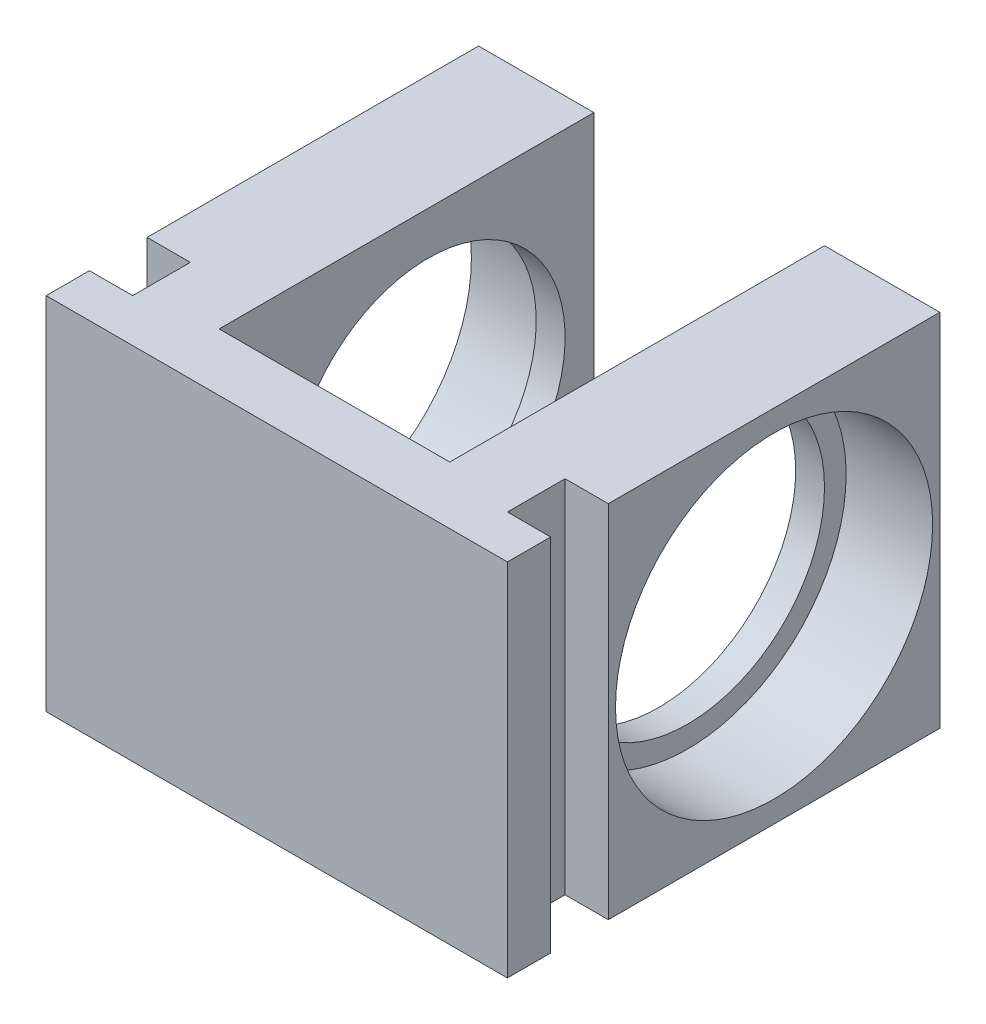
ISO-10303-21;
HEADER;
FILE_DESCRIPTION(('STEP AP214'),'2;1');
FILE_NAME('part.step','',(''),(''),'','','');
FILE_SCHEMA(('AUTOMOTIVE_DESIGN { 1 0 10303 214 1 1 1 1 }'));
ENDSEC;
DATA;
#1=APPLICATION_CONTEXT('core data for automotive mechanical design processes');
#2=APPLICATION_PROTOCOL_DEFINITION('international standard','automotive_design',2000,#1);
#3=PRODUCT_CONTEXT('',#1,'mechanical');
#4=PRODUCT('Part','Part','',(#3));
#5=PRODUCT_RELATED_PRODUCT_CATEGORY('part','',(#4));
#6=PRODUCT_DEFINITION_FORMATION('','',#4);
#7=PRODUCT_DEFINITION_CONTEXT('part definition',#1,'design');
#8=PRODUCT_DEFINITION('design','',#6,#7);
#9=PRODUCT_DEFINITION_SHAPE('','',#8);
#10=(LENGTH_UNIT() NAMED_UNIT(*) SI_UNIT(.MILLI.,.METRE.));
#11=(NAMED_UNIT(*) PLANE_ANGLE_UNIT() SI_UNIT($,.RADIAN.));
#12=(NAMED_UNIT(*) SI_UNIT($,.STERADIAN.) SOLID_ANGLE_UNIT());
#13=UNCERTAINTY_MEASURE_WITH_UNIT(LENGTH_MEASURE(1.E-05),#10,'distance_accuracy_value','');
#14=(GEOMETRIC_REPRESENTATION_CONTEXT(3) GLOBAL_UNCERTAINTY_ASSIGNED_CONTEXT((#13)) GLOBAL_UNIT_ASSIGNED_CONTEXT((#10,
#11,#12)) REPRESENTATION_CONTEXT('',''));
#15=CARTESIAN_POINT('',(0.,0.,0.));
#16=DIRECTION('',(0.,0.,1.));
#17=DIRECTION('',(1.,0.,0.));
#18=AXIS2_PLACEMENT_3D('',#15,#16,#17);
#19=CARTESIAN_POINT('',(19.,12.5,-14.5));
#20=DIRECTION('',(-1.,0.,0.));
#21=DIRECTION('',(0.,0.,1.));
#22=AXIS2_PLACEMENT_3D('',#19,#20,#21);
#23=CYLINDRICAL_SURFACE('',#22,9.5);
#24=CARTESIAN_POINT('',(8.,12.5,-14.5));
#25=DIRECTION('',(1.,0.,0.));
#26=DIRECTION('',(0.,0.,-1.));
#27=AXIS2_PLACEMENT_3D('',#24,#25,#26);
#28=CIRCLE('',#27,9.5);
#29=CARTESIAN_POINT('',(8.,12.5,-24.));
#30=VERTEX_POINT('',#29);
#31=EDGE_CURVE('E272',#30,#30,#28,.T.);
#32=ORIENTED_EDGE('',*,*,#31,.F.);
#33=EDGE_LOOP('',(#32));
#34=FACE_BOUND('',#33,.T.);
#35=CARTESIAN_POINT('',(10.,12.5,-14.5));
#36=DIRECTION('',(1.,0.,0.));
#37=DIRECTION('',(0.,0.,-1.));
#38=AXIS2_PLACEMENT_3D('',#35,#36,#37);
#39=CIRCLE('',#38,9.5);
#40=CARTESIAN_POINT('',(10.,12.5,-24.));
#41=VERTEX_POINT('',#40);
#42=EDGE_CURVE('E39',#41,#41,#39,.F.);
#43=ORIENTED_EDGE('',*,*,#42,.F.);
#44=EDGE_LOOP('',(#43));
#45=FACE_BOUND('',#44,.T.);
#46=ADVANCED_FACE('F35',(#34,#45),#23,.F.);
#47=CARTESIAN_POINT('',(-8.,12.5,-14.5));
#48=DIRECTION('',(-1.,0.,0.));
#49=DIRECTION('',(0.,0.,1.));
#50=AXIS2_PLACEMENT_3D('',#47,#48,#49);
#51=CIRCLE('',#50,9.5);
#52=CARTESIAN_POINT('',(-8.,12.5,-4.99999999999999));
#53=VERTEX_POINT('',#52);
#54=EDGE_CURVE('E176',#53,#53,#51,.T.);
#55=ORIENTED_EDGE('',*,*,#54,.F.);
#56=EDGE_LOOP('',(#55));
#57=FACE_BOUND('',#56,.T.);
#58=CARTESIAN_POINT('',(-10.,12.5,-14.5));
#59=DIRECTION('',(-1.,0.,0.));
#60=DIRECTION('',(0.,0.,1.));
#61=AXIS2_PLACEMENT_3D('',#58,#59,#60);
#62=CIRCLE('',#61,9.5);
#63=CARTESIAN_POINT('',(-10.,12.5,-4.99999999999999));
#64=VERTEX_POINT('',#63);
#65=EDGE_CURVE('E274',#64,#64,#62,.F.);
#66=ORIENTED_EDGE('',*,*,#65,.F.);
#67=EDGE_LOOP('',(#66));
#68=FACE_BOUND('',#67,.T.);
#69=ADVANCED_FACE('F299',(#57,#68),#23,.F.);
#70=CARTESIAN_POINT('',(-16.,25.,-26.));
#71=DIRECTION('',(1.,0.,0.));
#72=DIRECTION('',(0.,0.,-1.));
#73=AXIS2_PLACEMENT_3D('',#70,#71,#72);
#74=PLANE('',#73);
#75=CARTESIAN_POINT('',(-16.,12.5,-14.5));
#76=DIRECTION('',(-1.,0.,0.));
#77=DIRECTION('',(0.,0.,1.));
#78=AXIS2_PLACEMENT_3D('',#75,#76,#77);
#79=CIRCLE('',#78,11.);
#80=CARTESIAN_POINT('',(-16.,12.5,-3.49999999999999));
#81=VERTEX_POINT('',#80);
#82=EDGE_CURVE('E280',#81,#81,#79,.T.);
#83=ORIENTED_EDGE('',*,*,#82,.F.);
#84=EDGE_LOOP('',(#83));
#85=FACE_BOUND('',#84,.T.);
#86=DIRECTION('',(0.,0.,1.));
#87=VECTOR('',#86,1.);
#88=CARTESIAN_POINT('',(-16.,0.,-26.));
#89=LINE('',#88,#87);
#90=CARTESIAN_POINT('',(-16.,0.,-26.));
#91=VERTEX_POINT('',#90);
#92=CARTESIAN_POINT('',(-16.,0.,-2.99999999999999));
#93=VERTEX_POINT('',#92);
#94=EDGE_CURVE('E241',#91,#93,#89,.T.);
#95=ORIENTED_EDGE('',*,*,#94,.T.);
#96=DIRECTION('',(0.,-1.,0.));
#97=VECTOR('',#96,1.);
#98=CARTESIAN_POINT('',(-16.,25.,-2.99999999999999));
#99=LINE('',#98,#97);
#100=CARTESIAN_POINT('',(-16.,25.,-2.99999999999999));
#101=VERTEX_POINT('',#100);
#102=EDGE_CURVE('E182',#101,#93,#99,.T.);
#103=ORIENTED_EDGE('',*,*,#102,.F.);
#104=DIRECTION('',(0.,0.,1.));
#105=VECTOR('',#104,1.);
#106=CARTESIAN_POINT('',(-16.,25.,-26.));
#107=LINE('',#106,#105);
#108=CARTESIAN_POINT('',(-16.,25.,-26.));
#109=VERTEX_POINT('',#108);
#110=EDGE_CURVE('E170',#109,#101,#107,.T.);
#111=ORIENTED_EDGE('',*,*,#110,.F.);
#112=DIRECTION('',(0.,-1.,0.));
#113=VECTOR('',#112,1.);
#114=CARTESIAN_POINT('',(-16.,25.,-26.));
#115=LINE('',#114,#113);
#116=EDGE_CURVE('E267',#109,#91,#115,.T.);
#117=ORIENTED_EDGE('',*,*,#116,.T.);
#118=EDGE_LOOP('',(#95,#103,#111,#117));
#119=FACE_BOUND('',#118,.T.);
#120=ADVANCED_FACE('F305',(#85,#119),#74,.F.);
#121=CARTESIAN_POINT('',(16.,25.,-26.));
#122=DIRECTION('',(-1.,0.,0.));
#123=DIRECTION('',(0.,0.,1.));
#124=AXIS2_PLACEMENT_3D('',#121,#122,#123);
#125=PLANE('',#124);
#126=CARTESIAN_POINT('',(16.,12.5,-14.5));
#127=DIRECTION('',(1.,0.,0.));
#128=DIRECTION('',(0.,0.,-1.));
#129=AXIS2_PLACEMENT_3D('',#126,#127,#128);
#130=CIRCLE('',#129,11.);
#131=CARTESIAN_POINT('',(16.,12.5,-25.5));
#132=VERTEX_POINT('',#131);
#133=EDGE_CURVE('E286',#132,#132,#130,.T.);
#134=ORIENTED_EDGE('',*,*,#133,.F.);
#135=EDGE_LOOP('',(#134));
#136=FACE_BOUND('',#135,.T.);
#137=DIRECTION('',(0.,0.,-1.));
#138=VECTOR('',#137,1.);
#139=CARTESIAN_POINT('',(16.,25.,-26.));
#140=LINE('',#139,#138);
#141=CARTESIAN_POINT('',(16.,25.,-2.99999999999999));
#142=VERTEX_POINT('',#141);
#143=CARTESIAN_POINT('',(16.,25.,-26.));
#144=VERTEX_POINT('',#143);
#145=EDGE_CURVE('E225',#142,#144,#140,.T.);
#146=ORIENTED_EDGE('',*,*,#145,.F.);
#147=DIRECTION('',(0.,-1.,0.));
#148=VECTOR('',#147,1.);
#149=CARTESIAN_POINT('',(16.,25.,-2.99999999999999));
#150=LINE('',#149,#148);
#151=CARTESIAN_POINT('',(16.,0.,-2.99999999999999));
#152=VERTEX_POINT('',#151);
#153=EDGE_CURVE('E204',#142,#152,#150,.T.);
#154=ORIENTED_EDGE('',*,*,#153,.T.);
#155=DIRECTION('',(0.,0.,-1.));
#156=VECTOR('',#155,1.);
#157=CARTESIAN_POINT('',(16.,0.,-26.));
#158=LINE('',#157,#156);
#159=CARTESIAN_POINT('',(16.,0.,-26.));
#160=VERTEX_POINT('',#159);
#161=EDGE_CURVE('E246',#152,#160,#158,.T.);
#162=ORIENTED_EDGE('',*,*,#161,.T.);
#163=DIRECTION('',(0.,-1.,0.));
#164=VECTOR('',#163,1.);
#165=CARTESIAN_POINT('',(16.,25.,-26.));
#166=LINE('',#165,#164);
#167=EDGE_CURVE('E258',#144,#160,#166,.T.);
#168=ORIENTED_EDGE('',*,*,#167,.F.);
#169=EDGE_LOOP('',(#146,#154,#162,#168));
#170=FACE_BOUND('',#169,.T.);
#171=ADVANCED_FACE('F351',(#136,#170),#125,.F.);
#172=CARTESIAN_POINT('',(8.,25.,0.));
#173=DIRECTION('',(0.,0.,1.));
#174=DIRECTION('',(1.,0.,0.));
#175=AXIS2_PLACEMENT_3D('',#172,#173,#174);
#176=PLANE('',#175);
#177=DIRECTION('',(-1.,0.,0.));
#178=VECTOR('',#177,1.);
#179=CARTESIAN_POINT('',(8.,0.,0.));
#180=LINE('',#179,#178);
#181=CARTESIAN_POINT('',(8.,0.,0.));
#182=VERTEX_POINT('',#181);
#183=CARTESIAN_POINT('',(-8.,0.,0.));
#184=VERTEX_POINT('',#183);
#185=EDGE_CURVE('E207',#182,#184,#180,.T.);
#186=ORIENTED_EDGE('',*,*,#185,.T.);
#187=DIRECTION('',(0.,-1.,0.));
#188=VECTOR('',#187,1.);
#189=CARTESIAN_POINT('',(-8.,25.,0.));
#190=LINE('',#189,#188);
#191=CARTESIAN_POINT('',(-8.,25.,0.));
#192=VERTEX_POINT('',#191);
#193=EDGE_CURVE('E11',#192,#184,#190,.T.);
#194=ORIENTED_EDGE('',*,*,#193,.F.);
#195=DIRECTION('',(-1.,0.,0.));
#196=VECTOR('',#195,1.);
#197=CARTESIAN_POINT('',(8.,25.,0.));
#198=LINE('',#197,#196);
#199=CARTESIAN_POINT('',(8.,25.,0.));
#200=VERTEX_POINT('',#199);
#201=EDGE_CURVE('E213',#200,#192,#198,.T.);
#202=ORIENTED_EDGE('',*,*,#201,.F.);
#203=DIRECTION('',(0.,-1.,0.));
#204=VECTOR('',#203,1.);
#205=CARTESIAN_POINT('',(8.,25.,0.));
#206=LINE('',#205,#204);
#207=EDGE_CURVE('E233',#200,#182,#206,.T.);
#208=ORIENTED_EDGE('',*,*,#207,.T.);
#209=EDGE_LOOP('',(#186,#194,#202,#208));
#210=FACE_BOUND('',#209,.T.);
#211=ADVANCED_FACE('F37',(#210),#176,.F.);
#212=CARTESIAN_POINT('',(-8.,25.,0.));
#213=DIRECTION('',(-1.,0.,0.));
#214=DIRECTION('',(0.,0.,1.));
#215=AXIS2_PLACEMENT_3D('',#212,#213,#214);
#216=PLANE('',#215);
#217=ORIENTED_EDGE('',*,*,#54,.T.);
#218=EDGE_LOOP('',(#217));
#219=FACE_BOUND('',#218,.T.);
#220=DIRECTION('',(0.,0.,-1.));
#221=VECTOR('',#220,1.);
#222=CARTESIAN_POINT('',(-8.,0.,0.));
#223=LINE('',#222,#221);
#224=CARTESIAN_POINT('',(-8.,0.,-26.));
#225=VERTEX_POINT('',#224);
#226=EDGE_CURVE('E236',#184,#225,#223,.T.);
#227=ORIENTED_EDGE('',*,*,#226,.T.);
#228=DIRECTION('',(0.,-1.,0.));
#229=VECTOR('',#228,1.);
#230=CARTESIAN_POINT('',(-8.,25.,-26.));
#231=LINE('',#230,#229);
#232=CARTESIAN_POINT('',(-8.,25.,-26.));
#233=VERTEX_POINT('',#232);
#234=EDGE_CURVE('E44',#233,#225,#231,.T.);
#235=ORIENTED_EDGE('',*,*,#234,.F.);
#236=DIRECTION('',(0.,0.,-1.));
#237=VECTOR('',#236,1.);
#238=CARTESIAN_POINT('',(-8.,25.,0.));
#239=LINE('',#238,#237);
#240=EDGE_CURVE('E216',#192,#233,#239,.T.);
#241=ORIENTED_EDGE('',*,*,#240,.F.);
#242=ORIENTED_EDGE('',*,*,#193,.T.);
#243=EDGE_LOOP('',(#227,#235,#241,#242));
#244=FACE_BOUND('',#243,.T.);
#245=ADVANCED_FACE('F361',(#219,#244),#216,.F.);
#246=CARTESIAN_POINT('',(-8.,25.,-26.));
#247=DIRECTION('',(0.,0.,1.));
#248=DIRECTION('',(1.,0.,0.));
#249=AXIS2_PLACEMENT_3D('',#246,#247,#248);
#250=PLANE('',#249);
#251=DIRECTION('',(-1.,0.,0.));
#252=VECTOR('',#251,1.);
#253=CARTESIAN_POINT('',(-8.,0.,-26.));
#254=LINE('',#253,#252);
#255=EDGE_CURVE('E238',#225,#91,#254,.T.);
#256=ORIENTED_EDGE('',*,*,#255,.T.);
#257=ORIENTED_EDGE('',*,*,#116,.F.);
#258=DIRECTION('',(-1.,0.,0.));
#259=VECTOR('',#258,1.);
#260=CARTESIAN_POINT('',(-8.,25.,-26.));
#261=LINE('',#260,#259);
#262=EDGE_CURVE('E219',#233,#109,#261,.T.);
#263=ORIENTED_EDGE('',*,*,#262,.F.);
#264=ORIENTED_EDGE('',*,*,#234,.T.);
#265=EDGE_LOOP('',(#256,#257,#263,#264));
#266=FACE_BOUND('',#265,.T.);
#267=ADVANCED_FACE('F358',(#266),#250,.F.);
#268=CARTESIAN_POINT('',(-16.,25.,1.00000000000001));
#269=VERTEX_POINT('',#268);
#270=CARTESIAN_POINT('',(-16.,25.,4.));
#271=VERTEX_POINT('',#270);
#272=EDGE_CURVE('E221',#269,#271,#107,.T.);
#273=ORIENTED_EDGE('',*,*,#272,.F.);
#274=DIRECTION('',(0.,-1.,0.));
#275=VECTOR('',#274,1.);
#276=CARTESIAN_POINT('',(-16.,25.,1.00000000000001));
#277=LINE('',#276,#275);
#278=CARTESIAN_POINT('',(-16.,0.,1.00000000000001));
#279=VERTEX_POINT('',#278);
#280=EDGE_CURVE('E185',#269,#279,#277,.T.);
#281=ORIENTED_EDGE('',*,*,#280,.T.);
#282=CARTESIAN_POINT('',(-16.,0.,4.));
#283=VERTEX_POINT('',#282);
#284=EDGE_CURVE('E240',#279,#283,#89,.T.);
#285=ORIENTED_EDGE('',*,*,#284,.T.);
#286=DIRECTION('',(0.,-1.,0.));
#287=VECTOR('',#286,1.);
#288=CARTESIAN_POINT('',(-16.,25.,4.));
#289=LINE('',#288,#287);
#290=EDGE_CURVE('E264',#271,#283,#289,.T.);
#291=ORIENTED_EDGE('',*,*,#290,.F.);
#292=EDGE_LOOP('',(#273,#281,#285,#291));
#293=FACE_BOUND('',#292,.T.);
#294=ADVANCED_FACE('F354',(#293),#74,.F.);
#295=CARTESIAN_POINT('',(-16.,25.,4.));
#296=DIRECTION('',(0.,0.,-1.));
#297=DIRECTION('',(-1.,0.,0.));
#298=AXIS2_PLACEMENT_3D('',#295,#296,#297);
#299=PLANE('',#298);
#300=DIRECTION('',(1.,0.,0.));
#301=VECTOR('',#300,1.);
#302=CARTESIAN_POINT('',(-16.,0.,4.));
#303=LINE('',#302,#301);
#304=CARTESIAN_POINT('',(16.,0.,4.));
#305=VERTEX_POINT('',#304);
#306=EDGE_CURVE('E244',#283,#305,#303,.T.);
#307=ORIENTED_EDGE('',*,*,#306,.T.);
#308=DIRECTION('',(0.,-1.,0.));
#309=VECTOR('',#308,1.);
#310=CARTESIAN_POINT('',(16.,25.,4.));
#311=LINE('',#310,#309);
#312=CARTESIAN_POINT('',(16.,25.,4.));
#313=VERTEX_POINT('',#312);
#314=EDGE_CURVE('E261',#313,#305,#311,.T.);
#315=ORIENTED_EDGE('',*,*,#314,.F.);
#316=DIRECTION('',(1.,0.,0.));
#317=VECTOR('',#316,1.);
#318=CARTESIAN_POINT('',(-16.,25.,4.));
#319=LINE('',#318,#317);
#320=EDGE_CURVE('E223',#271,#313,#319,.T.);
#321=ORIENTED_EDGE('',*,*,#320,.F.);
#322=ORIENTED_EDGE('',*,*,#290,.T.);
#323=EDGE_LOOP('',(#307,#315,#321,#322));
#324=FACE_BOUND('',#323,.T.);
#325=ADVANCED_FACE('F349',(#324),#299,.F.);
#326=CARTESIAN_POINT('',(16.,0.,1.00000000000001));
#327=VERTEX_POINT('',#326);
#328=EDGE_CURVE('E247',#305,#327,#158,.T.);
#329=ORIENTED_EDGE('',*,*,#328,.T.);
#330=DIRECTION('',(0.,-1.,0.));
#331=VECTOR('',#330,1.);
#332=CARTESIAN_POINT('',(16.,25.,1.00000000000001));
#333=LINE('',#332,#331);
#334=CARTESIAN_POINT('',(16.,25.,1.00000000000001));
#335=VERTEX_POINT('',#334);
#336=EDGE_CURVE('E60',#335,#327,#333,.T.);
#337=ORIENTED_EDGE('',*,*,#336,.F.);
#338=EDGE_CURVE('E226',#313,#335,#140,.T.);
#339=ORIENTED_EDGE('',*,*,#338,.F.);
#340=ORIENTED_EDGE('',*,*,#314,.T.);
#341=EDGE_LOOP('',(#329,#337,#339,#340));
#342=FACE_BOUND('',#341,.T.);
#343=ADVANCED_FACE('F345',(#342),#125,.F.);
#344=CARTESIAN_POINT('',(8.,25.,-26.));
#345=DIRECTION('',(0.,0.,1.));
#346=DIRECTION('',(1.,0.,0.));
#347=AXIS2_PLACEMENT_3D('',#344,#345,#346);
#348=PLANE('',#347);
#349=DIRECTION('',(-1.,0.,0.));
#350=VECTOR('',#349,1.);
#351=CARTESIAN_POINT('',(8.,0.,-26.));
#352=LINE('',#351,#350);
#353=CARTESIAN_POINT('',(8.,0.,-26.));
#354=VERTEX_POINT('',#353);
#355=EDGE_CURVE('E250',#160,#354,#352,.T.);
#356=ORIENTED_EDGE('',*,*,#355,.T.);
#357=DIRECTION('',(0.,-1.,0.));
#358=VECTOR('',#357,1.);
#359=CARTESIAN_POINT('',(8.,25.,-26.));
#360=LINE('',#359,#358);
#361=CARTESIAN_POINT('',(8.,25.,-26.));
#362=VERTEX_POINT('',#361);
#363=EDGE_CURVE('E255',#362,#354,#360,.T.);
#364=ORIENTED_EDGE('',*,*,#363,.F.);
#365=DIRECTION('',(-1.,0.,0.));
#366=VECTOR('',#365,1.);
#367=CARTESIAN_POINT('',(8.,25.,-26.));
#368=LINE('',#367,#366);
#369=EDGE_CURVE('E229',#144,#362,#368,.T.);
#370=ORIENTED_EDGE('',*,*,#369,.F.);
#371=ORIENTED_EDGE('',*,*,#167,.T.);
#372=EDGE_LOOP('',(#356,#364,#370,#371));
#373=FACE_BOUND('',#372,.T.);
#374=ADVANCED_FACE('F341',(#373),#348,.F.);
#375=CARTESIAN_POINT('',(8.,25.,0.));
#376=DIRECTION('',(1.,0.,0.));
#377=DIRECTION('',(0.,0.,-1.));
#378=AXIS2_PLACEMENT_3D('',#375,#376,#377);
#379=PLANE('',#378);
#380=ORIENTED_EDGE('',*,*,#31,.T.);
#381=EDGE_LOOP('',(#380));
#382=FACE_BOUND('',#381,.T.);
#383=DIRECTION('',(0.,0.,1.));
#384=VECTOR('',#383,1.);
#385=CARTESIAN_POINT('',(8.,0.,0.));
#386=LINE('',#385,#384);
#387=EDGE_CURVE('E217',#354,#182,#386,.T.);
#388=ORIENTED_EDGE('',*,*,#387,.T.);
#389=ORIENTED_EDGE('',*,*,#207,.F.);
#390=DIRECTION('',(0.,0.,1.));
#391=VECTOR('',#390,1.);
#392=CARTESIAN_POINT('',(8.,25.,0.));
#393=LINE('',#392,#391);
#394=EDGE_CURVE('E231',#362,#200,#393,.T.);
#395=ORIENTED_EDGE('',*,*,#394,.F.);
#396=ORIENTED_EDGE('',*,*,#363,.T.);
#397=EDGE_LOOP('',(#388,#389,#395,#396));
#398=FACE_BOUND('',#397,.T.);
#399=ADVANCED_FACE('F335',(#382,#398),#379,.F.);
#400=CARTESIAN_POINT('',(0.,25.,0.));
#401=DIRECTION('',(0.,-1.,0.));
#402=DIRECTION('',(0.,0.,-1.));
#403=AXIS2_PLACEMENT_3D('',#400,#401,#402);
#404=PLANE('',#403);
#405=ORIENTED_EDGE('',*,*,#110,.T.);
#406=DIRECTION('',(1.,0.,0.));
#407=VECTOR('',#406,1.);
#408=CARTESIAN_POINT('',(-16.,25.,-2.99999999999999));
#409=LINE('',#408,#407);
#410=CARTESIAN_POINT('',(-13.,25.,-2.99999999999999));
#411=VERTEX_POINT('',#410);
#412=EDGE_CURVE('E152',#101,#411,#409,.T.);
#413=ORIENTED_EDGE('',*,*,#412,.T.);
#414=DIRECTION('',(0.,0.,1.));
#415=VECTOR('',#414,1.);
#416=CARTESIAN_POINT('',(-13.,25.,-2.99999999999999));
#417=LINE('',#416,#415);
#418=CARTESIAN_POINT('',(-13.,25.,1.00000000000001));
#419=VERTEX_POINT('',#418);
#420=EDGE_CURVE('E161',#411,#419,#417,.T.);
#421=ORIENTED_EDGE('',*,*,#420,.T.);
#422=DIRECTION('',(-1.,0.,0.));
#423=VECTOR('',#422,1.);
#424=CARTESIAN_POINT('',(-16.,25.,1.00000000000001));
#425=LINE('',#424,#423);
#426=EDGE_CURVE('E158',#419,#269,#425,.T.);
#427=ORIENTED_EDGE('',*,*,#426,.T.);
#428=ORIENTED_EDGE('',*,*,#272,.T.);
#429=ORIENTED_EDGE('',*,*,#320,.T.);
#430=ORIENTED_EDGE('',*,*,#338,.T.);
#431=DIRECTION('',(-1.,0.,0.));
#432=VECTOR('',#431,1.);
#433=CARTESIAN_POINT('',(16.,25.,1.00000000000001));
#434=LINE('',#433,#432);
#435=CARTESIAN_POINT('',(13.,25.,1.00000000000001));
#436=VERTEX_POINT('',#435);
#437=EDGE_CURVE('E189',#335,#436,#434,.T.);
#438=ORIENTED_EDGE('',*,*,#437,.T.);
#439=DIRECTION('',(0.,0.,-1.));
#440=VECTOR('',#439,1.);
#441=CARTESIAN_POINT('',(13.,25.,-2.99999999999999));
#442=LINE('',#441,#440);
#443=CARTESIAN_POINT('',(13.,25.,-2.99999999999999));
#444=VERTEX_POINT('',#443);
#445=EDGE_CURVE('E192',#436,#444,#442,.T.);
#446=ORIENTED_EDGE('',*,*,#445,.T.);
#447=DIRECTION('',(1.,0.,0.));
#448=VECTOR('',#447,1.);
#449=CARTESIAN_POINT('',(16.,25.,-2.99999999999999));
#450=LINE('',#449,#448);
#451=EDGE_CURVE('E196',#444,#142,#450,.T.);
#452=ORIENTED_EDGE('',*,*,#451,.T.);
#453=ORIENTED_EDGE('',*,*,#145,.T.);
#454=ORIENTED_EDGE('',*,*,#369,.T.);
#455=ORIENTED_EDGE('',*,*,#394,.T.);
#456=ORIENTED_EDGE('',*,*,#201,.T.);
#457=ORIENTED_EDGE('',*,*,#240,.T.);
#458=ORIENTED_EDGE('',*,*,#262,.T.);
#459=EDGE_LOOP('',(#405,#413,#421,#427,#428,#429,#430,#438,#446,#452,#453,#454,#455,#456,#457,#458));
#460=FACE_BOUND('',#459,.T.);
#461=ADVANCED_FACE('F168',(#460),#404,.F.);
#462=CARTESIAN_POINT('',(0.,0.,0.));
#463=DIRECTION('',(0.,-1.,0.));
#464=DIRECTION('',(0.,0.,-1.));
#465=AXIS2_PLACEMENT_3D('',#462,#463,#464);
#466=PLANE('',#465);
#467=DIRECTION('',(1.,0.,0.));
#468=VECTOR('',#467,1.);
#469=CARTESIAN_POINT('',(-16.,0.,-2.99999999999999));
#470=LINE('',#469,#468);
#471=CARTESIAN_POINT('',(-13.,0.,-2.99999999999999));
#472=VERTEX_POINT('',#471);
#473=EDGE_CURVE('E52',#93,#472,#470,.T.);
#474=ORIENTED_EDGE('',*,*,#473,.F.);
#475=ORIENTED_EDGE('',*,*,#94,.F.);
#476=ORIENTED_EDGE('',*,*,#255,.F.);
#477=ORIENTED_EDGE('',*,*,#226,.F.);
#478=ORIENTED_EDGE('',*,*,#185,.F.);
#479=ORIENTED_EDGE('',*,*,#387,.F.);
#480=ORIENTED_EDGE('',*,*,#355,.F.);
#481=ORIENTED_EDGE('',*,*,#161,.F.);
#482=DIRECTION('',(1.,0.,0.));
#483=VECTOR('',#482,1.);
#484=CARTESIAN_POINT('',(16.,0.,-2.99999999999999));
#485=LINE('',#484,#483);
#486=CARTESIAN_POINT('',(13.,0.,-2.99999999999999));
#487=VERTEX_POINT('',#486);
#488=EDGE_CURVE('E193',#487,#152,#485,.T.);
#489=ORIENTED_EDGE('',*,*,#488,.F.);
#490=DIRECTION('',(0.,0.,-1.));
#491=VECTOR('',#490,1.);
#492=CARTESIAN_POINT('',(13.,0.,-2.99999999999999));
#493=LINE('',#492,#491);
#494=CARTESIAN_POINT('',(13.,0.,1.00000000000001));
#495=VERTEX_POINT('',#494);
#496=EDGE_CURVE('E200',#495,#487,#493,.T.);
#497=ORIENTED_EDGE('',*,*,#496,.F.);
#498=DIRECTION('',(-1.,0.,0.));
#499=VECTOR('',#498,1.);
#500=CARTESIAN_POINT('',(16.,0.,1.00000000000001));
#501=LINE('',#500,#499);
#502=EDGE_CURVE('E184',#327,#495,#501,.T.);
#503=ORIENTED_EDGE('',*,*,#502,.F.);
#504=ORIENTED_EDGE('',*,*,#328,.F.);
#505=ORIENTED_EDGE('',*,*,#306,.F.);
#506=ORIENTED_EDGE('',*,*,#284,.F.);
#507=DIRECTION('',(-1.,0.,0.));
#508=VECTOR('',#507,1.);
#509=CARTESIAN_POINT('',(-16.,0.,1.00000000000001));
#510=LINE('',#509,#508);
#511=CARTESIAN_POINT('',(-13.,0.,1.00000000000001));
#512=VERTEX_POINT('',#511);
#513=EDGE_CURVE('E171',#512,#279,#510,.T.);
#514=ORIENTED_EDGE('',*,*,#513,.F.);
#515=DIRECTION('',(0.,0.,1.));
#516=VECTOR('',#515,1.);
#517=CARTESIAN_POINT('',(-13.,0.,-2.99999999999999));
#518=LINE('',#517,#516);
#519=EDGE_CURVE('E173',#472,#512,#518,.T.);
#520=ORIENTED_EDGE('',*,*,#519,.F.);
#521=EDGE_LOOP('',(#474,#475,#476,#477,#478,#479,#480,#481,#489,#497,#503,#504,#505,#506,#514,#520));
#522=FACE_BOUND('',#521,.T.);
#523=ADVANCED_FACE('F326',(#522),#466,.T.);
#524=CARTESIAN_POINT('',(16.,25.,-2.99999999999999));
#525=DIRECTION('',(0.,0.,-1.));
#526=DIRECTION('',(-1.,0.,0.));
#527=AXIS2_PLACEMENT_3D('',#524,#525,#526);
#528=PLANE('',#527);
#529=ORIENTED_EDGE('',*,*,#488,.T.);
#530=ORIENTED_EDGE('',*,*,#153,.F.);
#531=ORIENTED_EDGE('',*,*,#451,.F.);
#532=DIRECTION('',(0.,-1.,0.));
#533=VECTOR('',#532,1.);
#534=CARTESIAN_POINT('',(13.,25.,-2.99999999999999));
#535=LINE('',#534,#533);
#536=EDGE_CURVE('E208',#444,#487,#535,.T.);
#537=ORIENTED_EDGE('',*,*,#536,.T.);
#538=EDGE_LOOP('',(#529,#530,#531,#537));
#539=FACE_BOUND('',#538,.T.);
#540=ADVANCED_FACE('F322',(#539),#528,.F.);
#541=CARTESIAN_POINT('',(13.,25.,-2.99999999999999));
#542=DIRECTION('',(-1.,0.,0.));
#543=DIRECTION('',(0.,0.,1.));
#544=AXIS2_PLACEMENT_3D('',#541,#542,#543);
#545=PLANE('',#544);
#546=ORIENTED_EDGE('',*,*,#496,.T.);
#547=ORIENTED_EDGE('',*,*,#536,.F.);
#548=ORIENTED_EDGE('',*,*,#445,.F.);
#549=DIRECTION('',(0.,-1.,0.));
#550=VECTOR('',#549,1.);
#551=CARTESIAN_POINT('',(13.,25.,1.00000000000001));
#552=LINE('',#551,#550);
#553=EDGE_CURVE('E210',#436,#495,#552,.T.);
#554=ORIENTED_EDGE('',*,*,#553,.T.);
#555=EDGE_LOOP('',(#546,#547,#548,#554));
#556=FACE_BOUND('',#555,.T.);
#557=ADVANCED_FACE('F325',(#556),#545,.F.);
#558=CARTESIAN_POINT('',(16.,25.,1.00000000000001));
#559=DIRECTION('',(0.,0.,1.));
#560=DIRECTION('',(1.,0.,0.));
#561=AXIS2_PLACEMENT_3D('',#558,#559,#560);
#562=PLANE('',#561);
#563=ORIENTED_EDGE('',*,*,#502,.T.);
#564=ORIENTED_EDGE('',*,*,#553,.F.);
#565=ORIENTED_EDGE('',*,*,#437,.F.);
#566=ORIENTED_EDGE('',*,*,#336,.T.);
#567=EDGE_LOOP('',(#563,#564,#565,#566));
#568=FACE_BOUND('',#567,.T.);
#569=ADVANCED_FACE('F321',(#568),#562,.F.);
#570=CARTESIAN_POINT('',(-16.,25.,-2.99999999999999));
#571=DIRECTION('',(0.,0.,-1.));
#572=DIRECTION('',(-1.,0.,0.));
#573=AXIS2_PLACEMENT_3D('',#570,#571,#572);
#574=PLANE('',#573);
#575=ORIENTED_EDGE('',*,*,#473,.T.);
#576=DIRECTION('',(0.,-1.,0.));
#577=VECTOR('',#576,1.);
#578=CARTESIAN_POINT('',(-13.,25.,-2.99999999999999));
#579=LINE('',#578,#577);
#580=EDGE_CURVE('E148',#411,#472,#579,.T.);
#581=ORIENTED_EDGE('',*,*,#580,.F.);
#582=ORIENTED_EDGE('',*,*,#412,.F.);
#583=ORIENTED_EDGE('',*,*,#102,.T.);
#584=EDGE_LOOP('',(#575,#581,#582,#583));
#585=FACE_BOUND('',#584,.T.);
#586=ADVANCED_FACE('F150',(#585),#574,.F.);
#587=CARTESIAN_POINT('',(-16.,25.,1.00000000000001));
#588=DIRECTION('',(0.,0.,1.));
#589=DIRECTION('',(1.,0.,0.));
#590=AXIS2_PLACEMENT_3D('',#587,#588,#589);
#591=PLANE('',#590);
#592=ORIENTED_EDGE('',*,*,#513,.T.);
#593=ORIENTED_EDGE('',*,*,#280,.F.);
#594=ORIENTED_EDGE('',*,*,#426,.F.);
#595=DIRECTION('',(0.,-1.,0.));
#596=VECTOR('',#595,1.);
#597=CARTESIAN_POINT('',(-13.,25.,1.00000000000001));
#598=LINE('',#597,#596);
#599=EDGE_CURVE('E157',#419,#512,#598,.T.);
#600=ORIENTED_EDGE('',*,*,#599,.T.);
#601=EDGE_LOOP('',(#592,#593,#594,#600));
#602=FACE_BOUND('',#601,.T.);
#603=ADVANCED_FACE('F312',(#602),#591,.F.);
#604=CARTESIAN_POINT('',(-13.,25.,-2.99999999999999));
#605=DIRECTION('',(1.,0.,0.));
#606=DIRECTION('',(0.,0.,-1.));
#607=AXIS2_PLACEMENT_3D('',#604,#605,#606);
#608=PLANE('',#607);
#609=ORIENTED_EDGE('',*,*,#519,.T.);
#610=ORIENTED_EDGE('',*,*,#599,.F.);
#611=ORIENTED_EDGE('',*,*,#420,.F.);
#612=ORIENTED_EDGE('',*,*,#580,.T.);
#613=EDGE_LOOP('',(#609,#610,#611,#612));
#614=FACE_BOUND('',#613,.T.);
#615=ADVANCED_FACE('F162',(#614),#608,.F.);
#616=CARTESIAN_POINT('',(-10.,12.5,-14.5));
#617=DIRECTION('',(-1.,0.,0.));
#618=DIRECTION('',(0.,0.,1.));
#619=AXIS2_PLACEMENT_3D('',#616,#617,#618);
#620=PLANE('',#619);
#621=CARTESIAN_POINT('',(-10.,12.5,-14.5));
#622=DIRECTION('',(-1.,0.,0.));
#623=DIRECTION('',(0.,0.,1.));
#624=AXIS2_PLACEMENT_3D('',#621,#622,#623);
#625=CIRCLE('',#624,11.);
#626=CARTESIAN_POINT('',(-9.99999999999999,12.5,-3.49999999999999));
#627=VERTEX_POINT('',#626);
#628=EDGE_CURVE('E276',#627,#627,#625,.T.);
#629=ORIENTED_EDGE('',*,*,#628,.T.);
#630=EDGE_LOOP('',(#629));
#631=FACE_BOUND('',#630,.T.);
#632=ORIENTED_EDGE('',*,*,#65,.T.);
#633=EDGE_LOOP('',(#632));
#634=FACE_BOUND('',#633,.T.);
#635=ADVANCED_FACE('F318',(#631,#634),#620,.T.);
#636=CARTESIAN_POINT('',(-10.,12.5,-14.5));
#637=DIRECTION('',(-1.,0.,0.));
#638=DIRECTION('',(0.,0.,1.));
#639=AXIS2_PLACEMENT_3D('',#636,#637,#638);
#640=CYLINDRICAL_SURFACE('',#639,11.);
#641=ORIENTED_EDGE('',*,*,#628,.F.);
#642=EDGE_LOOP('',(#641));
#643=FACE_BOUND('',#642,.T.);
#644=ORIENTED_EDGE('',*,*,#82,.T.);
#645=EDGE_LOOP('',(#644));
#646=FACE_BOUND('',#645,.T.);
#647=ADVANCED_FACE('F310',(#643,#646),#640,.F.);
#648=CARTESIAN_POINT('',(10.,12.5,-14.5));
#649=DIRECTION('',(1.,0.,0.));
#650=DIRECTION('',(0.,0.,-1.));
#651=AXIS2_PLACEMENT_3D('',#648,#649,#650);
#652=PLANE('',#651);
#653=CARTESIAN_POINT('',(10.,12.5,-14.5));
#654=DIRECTION('',(1.,0.,0.));
#655=DIRECTION('',(0.,0.,-1.));
#656=AXIS2_PLACEMENT_3D('',#653,#654,#655);
#657=CIRCLE('',#656,11.);
#658=CARTESIAN_POINT('',(10.,12.5,-25.5));
#659=VERTEX_POINT('',#658);
#660=EDGE_CURVE('E289',#659,#659,#657,.T.);
#661=ORIENTED_EDGE('',*,*,#660,.T.);
#662=EDGE_LOOP('',(#661));
#663=FACE_BOUND('',#662,.T.);
#664=ORIENTED_EDGE('',*,*,#42,.T.);
#665=EDGE_LOOP('',(#664));
#666=FACE_BOUND('',#665,.T.);
#667=ADVANCED_FACE('F296',(#663,#666),#652,.T.);
#668=CARTESIAN_POINT('',(10.,12.5,-14.5));
#669=DIRECTION('',(1.,0.,0.));
#670=DIRECTION('',(0.,0.,-1.));
#671=AXIS2_PLACEMENT_3D('',#668,#669,#670);
#672=CYLINDRICAL_SURFACE('',#671,11.);
#673=ORIENTED_EDGE('',*,*,#660,.F.);
#674=EDGE_LOOP('',(#673));
#675=FACE_BOUND('',#674,.T.);
#676=ORIENTED_EDGE('',*,*,#133,.T.);
#677=EDGE_LOOP('',(#676));
#678=FACE_BOUND('',#677,.T.);
#679=ADVANCED_FACE('F394',(#675,#678),#672,.F.);
#680=CLOSED_SHELL('',(#46,#69,#120,#171,#211,#245,#267,#294,#325,#343,#374,#399,#461,#523,#540,
#557,#569,#586,#603,#615,#635,#647,#667,#679));
#681=MANIFOLD_SOLID_BREP('B2',#680);
#682=ADVANCED_BREP_SHAPE_REPRESENTATION('',(#18,#681),#14);
#683=SHAPE_DEFINITION_REPRESENTATION(#9,#682);
ENDSEC;
END-ISO-10303-21;
